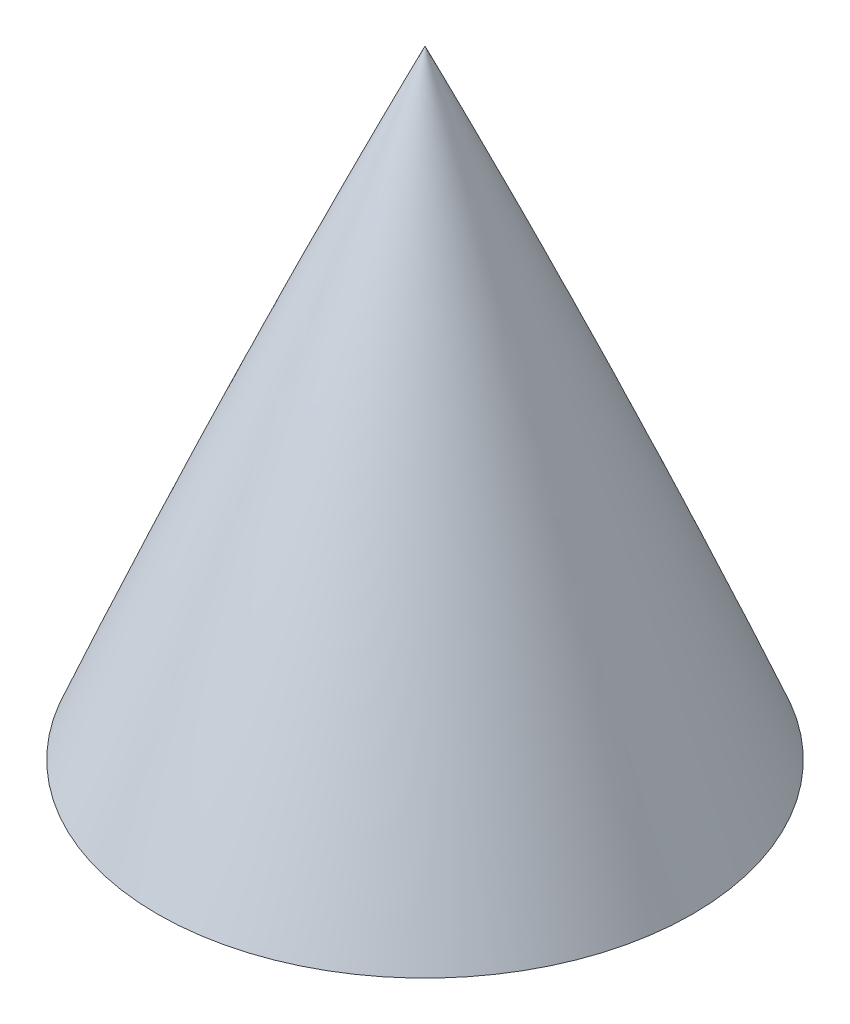
ISO-10303-21;
HEADER;
FILE_DESCRIPTION(('STEP AP214'),'2;1');
FILE_NAME('part.step','',(''),(''),'','','');
FILE_SCHEMA(('AUTOMOTIVE_DESIGN { 1 0 10303 214 1 1 1 1 }'));
ENDSEC;
DATA;
#1=APPLICATION_CONTEXT('core data for automotive mechanical design processes');
#2=APPLICATION_PROTOCOL_DEFINITION('international standard','automotive_design',2000,#1);
#3=PRODUCT_CONTEXT('',#1,'mechanical');
#4=PRODUCT('Part','Part','',(#3));
#5=PRODUCT_RELATED_PRODUCT_CATEGORY('part','',(#4));
#6=PRODUCT_DEFINITION_FORMATION('','',#4);
#7=PRODUCT_DEFINITION_CONTEXT('part definition',#1,'design');
#8=PRODUCT_DEFINITION('design','',#6,#7);
#9=PRODUCT_DEFINITION_SHAPE('','',#8);
#10=(LENGTH_UNIT() NAMED_UNIT(*) SI_UNIT(.MILLI.,.METRE.));
#11=(NAMED_UNIT(*) PLANE_ANGLE_UNIT() SI_UNIT($,.RADIAN.));
#12=(NAMED_UNIT(*) SI_UNIT($,.STERADIAN.) SOLID_ANGLE_UNIT());
#13=UNCERTAINTY_MEASURE_WITH_UNIT(LENGTH_MEASURE(1.E-05),#10,'distance_accuracy_value','');
#14=(GEOMETRIC_REPRESENTATION_CONTEXT(3) GLOBAL_UNCERTAINTY_ASSIGNED_CONTEXT((#13)) GLOBAL_UNIT_ASSIGNED_CONTEXT((#10,
#11,#12)) REPRESENTATION_CONTEXT('',''));
#15=CARTESIAN_POINT('',(0.,0.,0.));
#16=DIRECTION('',(0.,0.,1.));
#17=DIRECTION('',(1.,0.,0.));
#18=AXIS2_PLACEMENT_3D('',#15,#16,#17);
#19=CARTESIAN_POINT('',(992.113492782929,-78.5092148022566,0.));
#20=DIRECTION('',(0.,0.,-1.));
#21=DIRECTION('',(-1.,0.,0.));
#22=AXIS2_PLACEMENT_3D('',#19,#20,#21);
#23=CIRCLE('',#22,1093.36082838655);
#24=TRIMMED_CURVE('',#23,(PARAMETER_VALUE(-0.433745332323453)),
(PARAMETER_VALUE(0.433745332323453)),.T.,.PARAMETER.);
#25=CARTESIAN_POINT('',(-7.7715611723761E-13,-78.5092148022549,0.));
#26=DIRECTION('',(0.,1.,0.));
#27=AXIS1_PLACEMENT('',#25,#26);
#28=SURFACE_OF_REVOLUTION('',#24,#27);
#29=CARTESIAN_POINT('',(0.,381.,0.));
#30=VERTEX_POINT('',#29);
#31=VERTEX_LOOP('',#30);
#32=FACE_BOUND('',#31,.T.);
#33=CARTESIAN_POINT('',(0.,330.2,0.));
#34=DIRECTION('',(0.,-1.,0.));
#35=DIRECTION('',(1.,0.,0.));
#36=AXIS2_PLACEMENT_3D('',#33,#34,#35);
#37=CIRCLE('',#36,21.9844703280578);
#38=CARTESIAN_POINT('',(21.9844703280578,330.2,0.));
#39=VERTEX_POINT('',#38);
#40=EDGE_CURVE('E11',#39,#39,#37,.F.);
#41=ORIENTED_EDGE('',*,*,#40,.T.);
#42=EDGE_LOOP('',(#41));
#43=FACE_BOUND('',#42,.T.);
#44=ADVANCED_FACE('F38',(#32,#43),#28,.T.);
#45=CARTESIAN_POINT('',(-188.314971497888,330.2,83.0177250007011));
#46=DIRECTION('',(0.,-1.,0.));
#47=DIRECTION('',(1.,0.,0.));
#48=AXIS2_PLACEMENT_3D('',#45,#46,#47);
#49=PLANE('',#48);
#50=CARTESIAN_POINT('',(5.66129722309841E-13,330.2,0.));
#51=DIRECTION('',(0.,-1.,0.));
#52=DIRECTION('',(1.,0.,0.));
#53=AXIS2_PLACEMENT_3D('',#50,#51,#52);
#54=CIRCLE('',#53,2.413);
#55=CARTESIAN_POINT('',(2.41300000000057,330.2,0.));
#56=VERTEX_POINT('',#55);
#57=EDGE_CURVE('E69',#56,#56,#54,.T.);
#58=ORIENTED_EDGE('',*,*,#57,.F.);
#59=EDGE_LOOP('',(#58));
#60=FACE_BOUND('',#59,.T.);
#61=ORIENTED_EDGE('',*,*,#40,.F.);
#62=EDGE_LOOP('',(#61));
#63=FACE_BOUND('',#62,.T.);
#64=ADVANCED_FACE('F49',(#60,#63),#49,.T.);
#65=CARTESIAN_POINT('',(5.87903942398681E-13,342.9,0.));
#66=DIRECTION('',(0.,-1.,0.));
#67=DIRECTION('',(1.,0.,0.));
#68=AXIS2_PLACEMENT_3D('',#65,#66,#67);
#69=CYLINDRICAL_SURFACE('',#68,2.413);
#70=CARTESIAN_POINT('',(5.87903942398681E-13,342.9,0.));
#71=DIRECTION('',(0.,-1.,0.));
#72=DIRECTION('',(1.,0.,0.));
#73=AXIS2_PLACEMENT_3D('',#70,#71,#72);
#74=CIRCLE('',#73,2.413);
#75=CARTESIAN_POINT('',(2.41300000000059,342.9,0.));
#76=VERTEX_POINT('',#75);
#77=EDGE_CURVE('E44',#76,#76,#74,.T.);
#78=ORIENTED_EDGE('',*,*,#77,.F.);
#79=EDGE_LOOP('',(#78));
#80=FACE_BOUND('',#79,.T.);
#81=ORIENTED_EDGE('',*,*,#57,.T.);
#82=EDGE_LOOP('',(#81));
#83=FACE_BOUND('',#82,.T.);
#84=ADVANCED_FACE('F53',(#80,#83),#69,.F.);
#85=CARTESIAN_POINT('',(5.87903942398681E-13,342.9,0.));
#86=DIRECTION('',(0.,-1.,0.));
#87=DIRECTION('',(1.,0.,0.));
#88=AXIS2_PLACEMENT_3D('',#85,#86,#87);
#89=PLANE('',#88);
#90=ORIENTED_EDGE('',*,*,#77,.T.);
#91=EDGE_LOOP('',(#90));
#92=FACE_BOUND('',#91,.T.);
#93=ADVANCED_FACE('F58',(#92),#89,.T.);
#94=CLOSED_SHELL('',(#44,#64,#84,#93));
#95=MANIFOLD_SOLID_BREP('B2',#94);
#96=ADVANCED_BREP_SHAPE_REPRESENTATION('',(#18,#95),#14);
#97=SHAPE_DEFINITION_REPRESENTATION(#9,#96);
ENDSEC;
END-ISO-10303-21;
